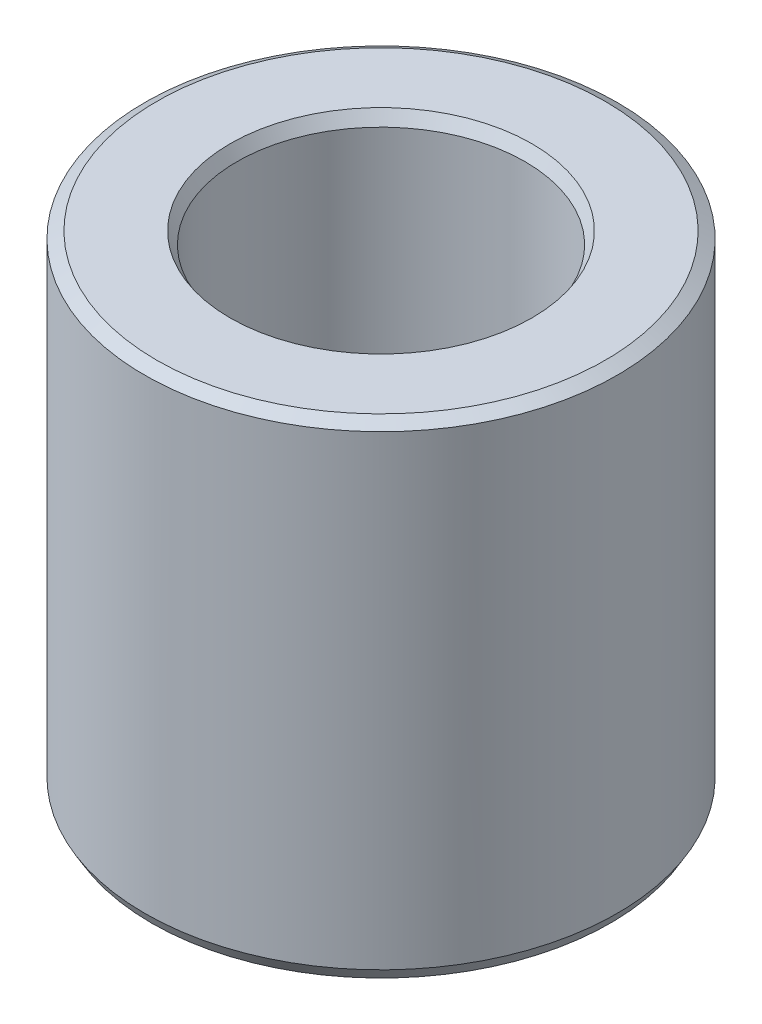
ISO-10303-21;
HEADER;
FILE_DESCRIPTION(('STEP AP214'),'2;1');
FILE_NAME('part.step','',(''),(''),'','','');
FILE_SCHEMA(('AUTOMOTIVE_DESIGN { 1 0 10303 214 1 1 1 1 }'));
ENDSEC;
DATA;
#1=APPLICATION_CONTEXT('core data for automotive mechanical design processes');
#2=APPLICATION_PROTOCOL_DEFINITION('international standard','automotive_design',2000,#1);
#3=PRODUCT_CONTEXT('',#1,'mechanical');
#4=PRODUCT('Part','Part','',(#3));
#5=PRODUCT_RELATED_PRODUCT_CATEGORY('part','',(#4));
#6=PRODUCT_DEFINITION_FORMATION('','',#4);
#7=PRODUCT_DEFINITION_CONTEXT('part definition',#1,'design');
#8=PRODUCT_DEFINITION('design','',#6,#7);
#9=PRODUCT_DEFINITION_SHAPE('','',#8);
#10=(LENGTH_UNIT() NAMED_UNIT(*) SI_UNIT(.MILLI.,.METRE.));
#11=(NAMED_UNIT(*) PLANE_ANGLE_UNIT() SI_UNIT($,.RADIAN.));
#12=(NAMED_UNIT(*) SI_UNIT($,.STERADIAN.) SOLID_ANGLE_UNIT());
#13=UNCERTAINTY_MEASURE_WITH_UNIT(LENGTH_MEASURE(1.E-05),#10,'distance_accuracy_value','');
#14=(GEOMETRIC_REPRESENTATION_CONTEXT(3) GLOBAL_UNCERTAINTY_ASSIGNED_CONTEXT((#13)) GLOBAL_UNIT_ASSIGNED_CONTEXT((#10,
#11,#12)) REPRESENTATION_CONTEXT('',''));
#15=CARTESIAN_POINT('',(0.,0.,0.));
#16=DIRECTION('',(0.,0.,1.));
#17=DIRECTION('',(1.,0.,0.));
#18=AXIS2_PLACEMENT_3D('',#15,#16,#17);
#19=CARTESIAN_POINT('',(0.,20.528602242612,0.));
#20=DIRECTION('',(0.,-1.,0.));
#21=DIRECTION('',(0.,0.,-1.));
#22=AXIS2_PLACEMENT_3D('',#19,#20,#21);
#23=CYLINDRICAL_SURFACE('',#22,10.);
#24=CARTESIAN_POINT('',(0.,0.508696812142721,0.));
#25=DIRECTION('',(0.,1.,0.));
#26=DIRECTION('',(0.,0.,1.));
#27=AXIS2_PLACEMENT_3D('',#24,#25,#26);
#28=CIRCLE('',#27,10.);
#29=CARTESIAN_POINT('',(0.,0.508696812142721,10.));
#30=VERTEX_POINT('',#29);
#31=EDGE_CURVE('E10',#30,#30,#28,.T.);
#32=ORIENTED_EDGE('',*,*,#31,.T.);
#33=EDGE_LOOP('',(#32));
#34=FACE_BOUND('',#33,.T.);
#35=CARTESIAN_POINT('',(0.,20.2349060011855,0.));
#36=DIRECTION('',(0.,1.,0.));
#37=DIRECTION('',(0.,0.,1.));
#38=AXIS2_PLACEMENT_3D('',#35,#36,#37);
#39=CIRCLE('',#38,10.);
#40=CARTESIAN_POINT('',(0.,20.2349060011855,-10.));
#41=VERTEX_POINT('',#40);
#42=EDGE_CURVE('E50',#41,#41,#39,.F.);
#43=ORIENTED_EDGE('',*,*,#42,.T.);
#44=EDGE_LOOP('',(#43));
#45=FACE_BOUND('',#44,.T.);
#46=ADVANCED_FACE('F39',(#34,#45),#23,.T.);
#47=CARTESIAN_POINT('',(0.,20.528602242612,0.));
#48=DIRECTION('',(0.,1.,0.));
#49=DIRECTION('',(0.,0.,1.));
#50=AXIS2_PLACEMENT_3D('',#47,#48,#49);
#51=PLANE('',#50);
#52=CARTESIAN_POINT('',(0.,20.528602242612,0.));
#53=DIRECTION('',(0.,1.,0.));
#54=DIRECTION('',(0.,0.,1.));
#55=AXIS2_PLACEMENT_3D('',#52,#53,#54);
#56=CIRCLE('',#55,6.38844529474361);
#57=CARTESIAN_POINT('',(0.,20.528602242612,6.38844529474361));
#58=VERTEX_POINT('',#57);
#59=EDGE_CURVE('E58',#58,#58,#56,.F.);
#60=ORIENTED_EDGE('',*,*,#59,.T.);
#61=EDGE_LOOP('',(#60));
#62=FACE_BOUND('',#61,.T.);
#63=CARTESIAN_POINT('',(0.,20.528602242612,0.));
#64=DIRECTION('',(0.,1.,0.));
#65=DIRECTION('',(0.,0.,1.));
#66=AXIS2_PLACEMENT_3D('',#63,#64,#65);
#67=CIRCLE('',#66,9.49130318785729);
#68=CARTESIAN_POINT('',(0.,20.528602242612,-9.49130318785729));
#69=VERTEX_POINT('',#68);
#70=EDGE_CURVE('E61',#69,#69,#67,.T.);
#71=ORIENTED_EDGE('',*,*,#70,.T.);
#72=EDGE_LOOP('',(#71));
#73=FACE_BOUND('',#72,.T.);
#74=ADVANCED_FACE('F88',(#62,#73),#51,.T.);
#75=CARTESIAN_POINT('',(0.,0.,0.));
#76=DIRECTION('',(0.,1.,0.));
#77=DIRECTION('',(0.,0.,1.));
#78=AXIS2_PLACEMENT_3D('',#75,#76,#77);
#79=PLANE('',#78);
#80=CARTESIAN_POINT('',(0.,0.,0.));
#81=DIRECTION('',(0.,1.,0.));
#82=DIRECTION('',(0.,0.,1.));
#83=AXIS2_PLACEMENT_3D('',#80,#81,#82);
#84=CIRCLE('',#83,6.60344586545983);
#85=CARTESIAN_POINT('',(0.,0.,6.60344586545983));
#86=VERTEX_POINT('',#85);
#87=EDGE_CURVE('E51',#86,#86,#84,.T.);
#88=ORIENTED_EDGE('',*,*,#87,.T.);
#89=EDGE_LOOP('',(#88));
#90=FACE_BOUND('',#89,.T.);
#91=CARTESIAN_POINT('',(0.,0.,0.));
#92=DIRECTION('',(0.,1.,0.));
#93=DIRECTION('',(0.,0.,1.));
#94=AXIS2_PLACEMENT_3D('',#91,#92,#93);
#95=CIRCLE('',#94,9.70630375857349);
#96=CARTESIAN_POINT('',(0.,0.,9.70630375857349));
#97=VERTEX_POINT('',#96);
#98=EDGE_CURVE('E54',#97,#97,#95,.F.);
#99=ORIENTED_EDGE('',*,*,#98,.T.);
#100=EDGE_LOOP('',(#99));
#101=FACE_BOUND('',#100,.T.);
#102=ADVANCED_FACE('F83',(#90,#101),#79,.F.);
#103=CARTESIAN_POINT('',(0.,20.528602242612,0.));
#104=DIRECTION('',(0.,-1.,0.));
#105=DIRECTION('',(0.,0.,-1.));
#106=AXIS2_PLACEMENT_3D('',#103,#104,#105);
#107=CYLINDRICAL_SURFACE('',#106,6.09474905331711);
#108=CARTESIAN_POINT('',(0.,20.0199054304693,0.));
#109=DIRECTION('',(0.,1.,0.));
#110=DIRECTION('',(0.,0.,1.));
#111=AXIS2_PLACEMENT_3D('',#108,#109,#110);
#112=CIRCLE('',#111,6.09474905331711);
#113=CARTESIAN_POINT('',(0.,20.0199054304693,6.09474905331711));
#114=VERTEX_POINT('',#113);
#115=EDGE_CURVE('E67',#114,#114,#112,.T.);
#116=ORIENTED_EDGE('',*,*,#115,.T.);
#117=EDGE_LOOP('',(#116));
#118=FACE_BOUND('',#117,.T.);
#119=CARTESIAN_POINT('',(0.,0.293696241426507,0.));
#120=DIRECTION('',(0.,1.,0.));
#121=DIRECTION('',(0.,0.,1.));
#122=AXIS2_PLACEMENT_3D('',#119,#120,#121);
#123=CIRCLE('',#122,6.09474905331711);
#124=CARTESIAN_POINT('',(0.,0.293696241426507,6.09474905331711));
#125=VERTEX_POINT('',#124);
#126=EDGE_CURVE('E69',#125,#125,#123,.F.);
#127=ORIENTED_EDGE('',*,*,#126,.T.);
#128=EDGE_LOOP('',(#127));
#129=FACE_BOUND('',#128,.T.);
#130=ADVANCED_FACE('F71',(#118,#129),#107,.F.);
#131=CARTESIAN_POINT('',(0.,20.0199054304693,0.));
#132=DIRECTION('',(0.,1.,0.));
#133=DIRECTION('',(0.,0.,1.));
#134=AXIS2_PLACEMENT_3D('',#131,#132,#133);
#135=CONICAL_SURFACE('',#134,6.09474905331711,0.5235987755983);
#136=ORIENTED_EDGE('',*,*,#59,.F.);
#137=EDGE_LOOP('',(#136));
#138=FACE_BOUND('',#137,.T.);
#139=ORIENTED_EDGE('',*,*,#115,.F.);
#140=EDGE_LOOP('',(#139));
#141=FACE_BOUND('',#140,.T.);
#142=ADVANCED_FACE('F77',(#138,#141),#135,.F.);
#143=CARTESIAN_POINT('',(0.,0.,0.));
#144=DIRECTION('',(0.,-1.,0.));
#145=DIRECTION('',(0.,0.,-1.));
#146=AXIS2_PLACEMENT_3D('',#143,#144,#145);
#147=CONICAL_SURFACE('',#146,6.60344586545983,1.0471975511966);
#148=ORIENTED_EDGE('',*,*,#126,.F.);
#149=EDGE_LOOP('',(#148));
#150=FACE_BOUND('',#149,.T.);
#151=ORIENTED_EDGE('',*,*,#87,.F.);
#152=EDGE_LOOP('',(#151));
#153=FACE_BOUND('',#152,.T.);
#154=ADVANCED_FACE('F73',(#150,#153),#147,.F.);
#155=CARTESIAN_POINT('',(0.,0.508696812142721,0.));
#156=DIRECTION('',(0.,1.,0.));
#157=DIRECTION('',(0.,0.,1.));
#158=AXIS2_PLACEMENT_3D('',#155,#156,#157);
#159=CONICAL_SURFACE('',#158,10.,0.523598775598305);
#160=ORIENTED_EDGE('',*,*,#98,.F.);
#161=EDGE_LOOP('',(#160));
#162=FACE_BOUND('',#161,.T.);
#163=ORIENTED_EDGE('',*,*,#31,.F.);
#164=EDGE_LOOP('',(#163));
#165=FACE_BOUND('',#164,.T.);
#166=ADVANCED_FACE('F76',(#162,#165),#159,.T.);
#167=CARTESIAN_POINT('',(0.,20.528602242612,0.));
#168=DIRECTION('',(0.,-1.,0.));
#169=DIRECTION('',(0.,0.,-1.));
#170=AXIS2_PLACEMENT_3D('',#167,#168,#169);
#171=CONICAL_SURFACE('',#170,9.49130318785729,1.04719755119659);
#172=CARTESIAN_POINT('',(0.,20.2349060011855,-10.));
#173=CARTESIAN_POINT('',(0.,20.2379653370337,-9.99470107487352));
#174=CARTESIAN_POINT('',(0.,20.2410246728819,-9.98940214974703));
#175=CARTESIAN_POINT('',(0.,20.2471433445783,-9.97880429949406));
#176=CARTESIAN_POINT('',(0.,20.2502026804265,-9.97350537436757));
#177=CARTESIAN_POINT('',(0.,20.2563213521229,-9.9629075241146));
#178=CARTESIAN_POINT('',(0.,20.2593806879711,-9.95760859898811));
#179=CARTESIAN_POINT('',(0.,20.2654993596675,-9.94701074873514));
#180=CARTESIAN_POINT('',(0.,20.2685586955157,-9.94171182360865));
#181=CARTESIAN_POINT('',(0.,20.274677367212,-9.93111397335568));
#182=CARTESIAN_POINT('',(0.,20.2777367030602,-9.92581504822919));
#183=CARTESIAN_POINT('',(0.,20.2838553747566,-9.91521719797622));
#184=CARTESIAN_POINT('',(0.,20.2869147106048,-9.90991827284973));
#185=CARTESIAN_POINT('',(0.,20.2930333823012,-9.89932042259676));
#186=CARTESIAN_POINT('',(0.,20.2960927181494,-9.89402149747027));
#187=CARTESIAN_POINT('',(0.,20.3022113898458,-9.8834236472173));
#188=CARTESIAN_POINT('',(0.,20.305270725694,-9.87812472209081));
#189=CARTESIAN_POINT('',(0.,20.3113893973904,-9.86752687183784));
#190=CARTESIAN_POINT('',(0.,20.3144487332386,-9.86222794671135));
#191=CARTESIAN_POINT('',(0.,20.3205674049349,-9.85163009645838));
#192=CARTESIAN_POINT('',(0.,20.3236267407831,-9.84633117133189));
#193=CARTESIAN_POINT('',(0.,20.3297454124795,-9.83573332107892));
#194=CARTESIAN_POINT('',(0.,20.3328047483277,-9.83043439595243));
#195=CARTESIAN_POINT('',(0.,20.3389234200241,-9.81983654569946));
#196=CARTESIAN_POINT('',(0.,20.3419827558723,-9.81453762057298));
#197=CARTESIAN_POINT('',(0.,20.3481014275687,-9.80393977032));
#198=CARTESIAN_POINT('',(0.,20.3511607634169,-9.79864084519351));
#199=CARTESIAN_POINT('',(0.,20.3572794351132,-9.78804299494054));
#200=CARTESIAN_POINT('',(0.,20.3603387709614,-9.78274406981405));
#201=CARTESIAN_POINT('',(0.,20.3664574426578,-9.77214621956108));
#202=CARTESIAN_POINT('',(0.,20.369516778506,-9.76684729443459));
#203=CARTESIAN_POINT('',(0.,20.3756354502024,-9.75624944418162));
#204=CARTESIAN_POINT('',(0.,20.3786947860506,-9.75095051905513));
#205=CARTESIAN_POINT('',(0.,20.384813457747,-9.74035266880216));
#206=CARTESIAN_POINT('',(0.,20.3878727935952,-9.73505374367567));
#207=CARTESIAN_POINT('',(0.,20.3939914652916,-9.7244558934227));
#208=CARTESIAN_POINT('',(0.,20.3970508011398,-9.71915696829621));
#209=CARTESIAN_POINT('',(0.,20.4031694728361,-9.70855911804324));
#210=CARTESIAN_POINT('',(0.,20.4062288086843,-9.70326019291675));
#211=CARTESIAN_POINT('',(0.,20.4123474803807,-9.69266234266378));
#212=CARTESIAN_POINT('',(0.,20.4154068162289,-9.68736341753729));
#213=CARTESIAN_POINT('',(0.,20.4215254879253,-9.67676556728432));
#214=CARTESIAN_POINT('',(0.,20.4245848237735,-9.67146664215784));
#215=CARTESIAN_POINT('',(0.,20.4307034954699,-9.66086879190486));
#216=CARTESIAN_POINT('',(0.,20.4337628313181,-9.65556986677838));
#217=CARTESIAN_POINT('',(0.,20.4398815030145,-9.6449720165254));
#218=CARTESIAN_POINT('',(0.,20.4429408388626,-9.63967309139892));
#219=CARTESIAN_POINT('',(0.,20.449059510559,-9.62907524114594));
#220=CARTESIAN_POINT('',(0.,20.4521188464072,-9.62377631601946));
#221=CARTESIAN_POINT('',(0.,20.4582375181036,-9.61317846576648));
#222=CARTESIAN_POINT('',(0.,20.4612968539518,-9.60787954064));
#223=CARTESIAN_POINT('',(0.,20.4674155256482,-9.59728169038702));
#224=CARTESIAN_POINT('',(0.,20.4704748614964,-9.59198276526054));
#225=CARTESIAN_POINT('',(0.,20.4765935331928,-9.58138491500756));
#226=CARTESIAN_POINT('',(0.,20.479652869041,-9.57608598988108));
#227=CARTESIAN_POINT('',(0.,20.4857715407373,-9.5654881396281));
#228=CARTESIAN_POINT('',(0.,20.4888308765855,-9.56018921450162));
#229=CARTESIAN_POINT('',(0.,20.4949495482819,-9.54959136424864));
#230=CARTESIAN_POINT('',(0.,20.4980088841301,-9.54429243912216));
#231=CARTESIAN_POINT('',(0.,20.5041275558265,-9.53369458886919));
#232=CARTESIAN_POINT('',(0.,20.5071868916747,-9.5283956637427));
#233=CARTESIAN_POINT('',(0.,20.5133055633711,-9.51779781348973));
#234=CARTESIAN_POINT('',(0.,20.5163648992193,-9.51249888836324));
#235=CARTESIAN_POINT('',(0.,20.5224835709157,-9.50190103811027));
#236=CARTESIAN_POINT('',(0.,20.5255429067638,-9.49660211298378));
#237=CARTESIAN_POINT('',(0.,20.528602242612,-9.49130318785729));
#238=B_SPLINE_CURVE_WITH_KNOTS('',3,(#172,#173,#174,#175,#176,#177,#178,#179,#180,#181,#182,
#183,#184,#185,#186,#187,#188,#189,#190,#191,#192,#193,#194,#195,#196,#197,#198,#199,#200,#201,
#202,#203,#204,#205,#206,#207,#208,#209,#210,#211,#212,#213,#214,#215,#216,#217,#218,#219,#220,
#221,#222,#223,#224,#225,#226,#227,#228,#229,#230,#231,#232,#233,#234,#235,#236,#237),
.UNSPECIFIED.,.F.,.F.,(4,2,2,2,2,2,2,2,2,2,2,2,2,2,2,2,2,2,2,2,2,2,2,2,2,2,2,2,2,2,2,2,4),(0.,
0.0183560150891581,0.0367120301783144,0.0550680452674708,0.0734240603566271,0.0917800754457835,
0.11013609053494,0.128492105624096,0.146848120713253,0.165204135802409,0.183560150891565,
0.201916165980722,0.220272181069876,0.238628196159033,0.256984211248189,0.275340226337345,
0.293696241426502,0.312052256515658,0.330408271604815,0.348764286693971,0.367120301783127,
0.385476316872284,0.40383233196144,0.422188347050596,0.440544362139753,0.458900377228909,
0.477256392318065,0.495612407407222,0.513968422496378,0.532324437585533,0.550680452674689,
0.569036467763846,0.587392482853004),.UNSPECIFIED.);
#239=EDGE_CURVE('BSEAM45',#41,#69,#238,.T.);
#240=ORIENTED_EDGE('',*,*,#42,.F.);
#241=ORIENTED_EDGE('',*,*,#70,.F.);
#242=ORIENTED_EDGE('',*,*,#239,.T.);
#243=ORIENTED_EDGE('',*,*,#239,.F.);
#244=EDGE_LOOP('',(#240,#242,#241,#243));
#245=FACE_BOUND('',#244,.T.);
#246=ADVANCED_FACE('F45',(#245),#171,.T.);
#247=CLOSED_SHELL('',(#46,#74,#102,#130,#142,#154,#166,#246));
#248=MANIFOLD_SOLID_BREP('B2',#247);
#249=ADVANCED_BREP_SHAPE_REPRESENTATION('',(#18,#248),#14);
#250=SHAPE_DEFINITION_REPRESENTATION(#9,#249);
ENDSEC;
END-ISO-10303-21;
